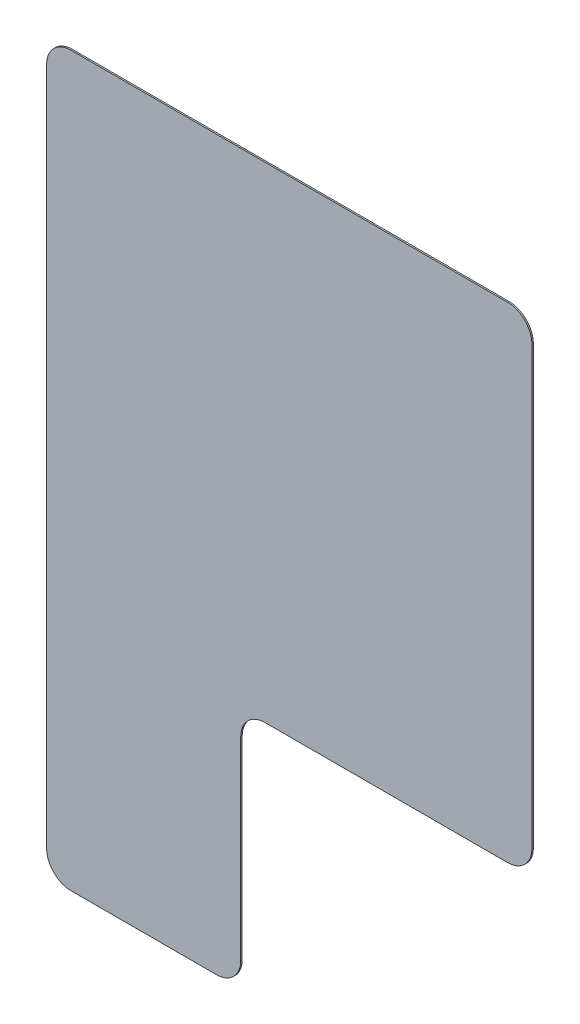
ISO-10303-21;
HEADER;
FILE_DESCRIPTION(('STEP AP214'),'2;1');
FILE_NAME('part.step','',(''),(''),'','','');
FILE_SCHEMA(('AUTOMOTIVE_DESIGN { 1 0 10303 214 1 1 1 1 }'));
ENDSEC;
DATA;
#1=APPLICATION_CONTEXT('core data for automotive mechanical design processes');
#2=APPLICATION_PROTOCOL_DEFINITION('international standard','automotive_design',2000,#1);
#3=PRODUCT_CONTEXT('',#1,'mechanical');
#4=PRODUCT('Part','Part','',(#3));
#5=PRODUCT_RELATED_PRODUCT_CATEGORY('part','',(#4));
#6=PRODUCT_DEFINITION_FORMATION('','',#4);
#7=PRODUCT_DEFINITION_CONTEXT('part definition',#1,'design');
#8=PRODUCT_DEFINITION('design','',#6,#7);
#9=PRODUCT_DEFINITION_SHAPE('','',#8);
#10=(LENGTH_UNIT() NAMED_UNIT(*) SI_UNIT(.MILLI.,.METRE.));
#11=(NAMED_UNIT(*) PLANE_ANGLE_UNIT() SI_UNIT($,.RADIAN.));
#12=(NAMED_UNIT(*) SI_UNIT($,.STERADIAN.) SOLID_ANGLE_UNIT());
#13=UNCERTAINTY_MEASURE_WITH_UNIT(LENGTH_MEASURE(1.E-05),#10,'distance_accuracy_value','');
#14=(GEOMETRIC_REPRESENTATION_CONTEXT(3) GLOBAL_UNCERTAINTY_ASSIGNED_CONTEXT((#13)) GLOBAL_UNIT_ASSIGNED_CONTEXT((#10,
#11,#12)) REPRESENTATION_CONTEXT('',''));
#15=CARTESIAN_POINT('',(0.,0.,0.));
#16=DIRECTION('',(0.,0.,1.));
#17=DIRECTION('',(1.,0.,0.));
#18=AXIS2_PLACEMENT_3D('',#15,#16,#17);
#19=CARTESIAN_POINT('',(-0.5,0.,0.015));
#20=DIRECTION('',(1.,0.,0.));
#21=DIRECTION('',(0.,0.,-1.));
#22=AXIS2_PLACEMENT_3D('',#19,#20,#21);
#23=PLANE('',#22);
#24=DIRECTION('',(0.,-1.,0.));
#25=VECTOR('',#24,1.);
#26=CARTESIAN_POINT('',(-0.5,0.,0.015));
#27=LINE('',#26,#25);
#28=CARTESIAN_POINT('',(-0.5,-2.75,0.015));
#29=VERTEX_POINT('',#28);
#30=CARTESIAN_POINT('',(-0.5,-4.75,0.015));
#31=VERTEX_POINT('',#30);
#32=EDGE_CURVE('E218',#29,#31,#27,.T.);
#33=ORIENTED_EDGE('',*,*,#32,.T.);
#34=DIRECTION('',(0.,0.,-1.));
#35=VECTOR('',#34,1.);
#36=CARTESIAN_POINT('',(-0.5,-4.75,0.));
#37=LINE('',#36,#35);
#38=CARTESIAN_POINT('',(-0.5,-4.75,0.));
#39=VERTEX_POINT('',#38);
#40=EDGE_CURVE('E189',#31,#39,#37,.T.);
#41=ORIENTED_EDGE('',*,*,#40,.T.);
#42=DIRECTION('',(0.,-1.,0.));
#43=VECTOR('',#42,1.);
#44=CARTESIAN_POINT('',(-0.5,0.,0.));
#45=LINE('',#44,#43);
#46=CARTESIAN_POINT('',(-0.5,-2.75,0.));
#47=VERTEX_POINT('',#46);
#48=EDGE_CURVE('E199',#47,#39,#45,.T.);
#49=ORIENTED_EDGE('',*,*,#48,.F.);
#50=DIRECTION('',(0.,0.,-1.));
#51=VECTOR('',#50,1.);
#52=CARTESIAN_POINT('',(-0.5,-2.75,0.015));
#53=LINE('',#52,#51);
#54=EDGE_CURVE('E187',#47,#29,#53,.F.);
#55=ORIENTED_EDGE('',*,*,#54,.T.);
#56=EDGE_LOOP('',(#33,#41,#49,#55));
#57=FACE_BOUND('',#56,.T.);
#58=ADVANCED_FACE('F35',(#57),#23,.T.);
#59=CARTESIAN_POINT('',(0.,-2.5,0.015));
#60=DIRECTION('',(0.,1.,0.));
#61=DIRECTION('',(0.,0.,1.));
#62=AXIS2_PLACEMENT_3D('',#59,#60,#61);
#63=PLANE('',#62);
#64=DIRECTION('',(1.,0.,0.));
#65=VECTOR('',#64,1.);
#66=CARTESIAN_POINT('',(0.,-2.5,0.015));
#67=LINE('',#66,#65);
#68=CARTESIAN_POINT('',(-0.25,-2.5,0.015));
#69=VERTEX_POINT('',#68);
#70=CARTESIAN_POINT('',(2.25,-2.5,0.015));
#71=VERTEX_POINT('',#70);
#72=EDGE_CURVE('E216',#69,#71,#67,.T.);
#73=ORIENTED_EDGE('',*,*,#72,.F.);
#74=DIRECTION('',(0.,0.,-1.));
#75=VECTOR('',#74,1.);
#76=CARTESIAN_POINT('',(-0.25,-2.5,0.015));
#77=LINE('',#76,#75);
#78=CARTESIAN_POINT('',(-0.25,-2.5,0.));
#79=VERTEX_POINT('',#78);
#80=EDGE_CURVE('E194',#69,#79,#77,.T.);
#81=ORIENTED_EDGE('',*,*,#80,.T.);
#82=DIRECTION('',(1.,0.,0.));
#83=VECTOR('',#82,1.);
#84=CARTESIAN_POINT('',(0.,-2.5,0.));
#85=LINE('',#84,#83);
#86=CARTESIAN_POINT('',(2.25,-2.5,0.));
#87=VERTEX_POINT('',#86);
#88=EDGE_CURVE('E201',#79,#87,#85,.T.);
#89=ORIENTED_EDGE('',*,*,#88,.T.);
#90=DIRECTION('',(0.,0.,-1.));
#91=VECTOR('',#90,1.);
#92=CARTESIAN_POINT('',(2.25,-2.5,0.015));
#93=LINE('',#92,#91);
#94=EDGE_CURVE('E192',#87,#71,#93,.F.);
#95=ORIENTED_EDGE('',*,*,#94,.T.);
#96=EDGE_LOOP('',(#73,#81,#89,#95));
#97=FACE_BOUND('',#96,.T.);
#98=ADVANCED_FACE('F220',(#97),#63,.F.);
#99=CARTESIAN_POINT('',(2.5,0.,0.015));
#100=DIRECTION('',(-1.,0.,0.));
#101=DIRECTION('',(0.,0.,1.));
#102=AXIS2_PLACEMENT_3D('',#99,#100,#101);
#103=PLANE('',#102);
#104=DIRECTION('',(0.,1.,0.));
#105=VECTOR('',#104,1.);
#106=CARTESIAN_POINT('',(2.5,0.,0.));
#107=LINE('',#106,#105);
#108=CARTESIAN_POINT('',(2.5,-2.25,0.));
#109=VERTEX_POINT('',#108);
#110=CARTESIAN_POINT('',(2.5,2.25,0.));
#111=VERTEX_POINT('',#110);
#112=EDGE_CURVE('E146',#109,#111,#107,.T.);
#113=ORIENTED_EDGE('',*,*,#112,.T.);
#114=DIRECTION('',(0.,0.,-1.));
#115=VECTOR('',#114,1.);
#116=CARTESIAN_POINT('',(2.5,2.25,0.015));
#117=LINE('',#116,#115);
#118=CARTESIAN_POINT('',(2.5,2.25,0.015));
#119=VERTEX_POINT('',#118);
#120=EDGE_CURVE('E169',#111,#119,#117,.F.);
#121=ORIENTED_EDGE('',*,*,#120,.T.);
#122=DIRECTION('',(0.,1.,0.));
#123=VECTOR('',#122,1.);
#124=CARTESIAN_POINT('',(2.5,0.,0.015));
#125=LINE('',#124,#123);
#126=CARTESIAN_POINT('',(2.5,-2.25,0.015));
#127=VERTEX_POINT('',#126);
#128=EDGE_CURVE('E222',#127,#119,#125,.T.);
#129=ORIENTED_EDGE('',*,*,#128,.F.);
#130=DIRECTION('',(0.,0.,-1.));
#131=VECTOR('',#130,1.);
#132=CARTESIAN_POINT('',(2.5,-2.25,0.015));
#133=LINE('',#132,#131);
#134=EDGE_CURVE('E166',#127,#109,#133,.T.);
#135=ORIENTED_EDGE('',*,*,#134,.T.);
#136=EDGE_LOOP('',(#113,#121,#129,#135));
#137=FACE_BOUND('',#136,.T.);
#138=ADVANCED_FACE('F250',(#137),#103,.F.);
#139=CARTESIAN_POINT('',(0.,2.5,0.015));
#140=DIRECTION('',(0.,1.,0.));
#141=DIRECTION('',(0.,0.,1.));
#142=AXIS2_PLACEMENT_3D('',#139,#140,#141);
#143=PLANE('',#142);
#144=DIRECTION('',(1.,0.,0.));
#145=VECTOR('',#144,1.);
#146=CARTESIAN_POINT('',(0.,2.5,0.015));
#147=LINE('',#146,#145);
#148=CARTESIAN_POINT('',(-2.25,2.5,0.015));
#149=VERTEX_POINT('',#148);
#150=CARTESIAN_POINT('',(2.25,2.5,0.015));
#151=VERTEX_POINT('',#150);
#152=EDGE_CURVE('E224',#149,#151,#147,.T.);
#153=ORIENTED_EDGE('',*,*,#152,.T.);
#154=DIRECTION('',(0.,0.,-1.));
#155=VECTOR('',#154,1.);
#156=CARTESIAN_POINT('',(2.25,2.5,0.));
#157=LINE('',#156,#155);
#158=CARTESIAN_POINT('',(2.25,2.5,0.));
#159=VERTEX_POINT('',#158);
#160=EDGE_CURVE('E145',#151,#159,#157,.T.);
#161=ORIENTED_EDGE('',*,*,#160,.T.);
#162=DIRECTION('',(1.,0.,0.));
#163=VECTOR('',#162,1.);
#164=CARTESIAN_POINT('',(0.,2.5,0.));
#165=LINE('',#164,#163);
#166=CARTESIAN_POINT('',(-2.25,2.5,0.));
#167=VERTEX_POINT('',#166);
#168=EDGE_CURVE('E128',#167,#159,#165,.T.);
#169=ORIENTED_EDGE('',*,*,#168,.F.);
#170=DIRECTION('',(0.,0.,-1.));
#171=VECTOR('',#170,1.);
#172=CARTESIAN_POINT('',(-2.25,2.5,0.015));
#173=LINE('',#172,#171);
#174=EDGE_CURVE('E142',#167,#149,#173,.F.);
#175=ORIENTED_EDGE('',*,*,#174,.T.);
#176=EDGE_LOOP('',(#153,#161,#169,#175));
#177=FACE_BOUND('',#176,.T.);
#178=ADVANCED_FACE('F141',(#177),#143,.T.);
#179=CARTESIAN_POINT('',(-2.5,0.,0.015));
#180=DIRECTION('',(1.,0.,0.));
#181=DIRECTION('',(0.,0.,-1.));
#182=AXIS2_PLACEMENT_3D('',#179,#180,#181);
#183=PLANE('',#182);
#184=DIRECTION('',(0.,-1.,0.));
#185=VECTOR('',#184,1.);
#186=CARTESIAN_POINT('',(-2.5,0.,0.015));
#187=LINE('',#186,#185);
#188=CARTESIAN_POINT('',(-2.5,2.25,0.015));
#189=VERTEX_POINT('',#188);
#190=CARTESIAN_POINT('',(-2.5,-4.75,0.015));
#191=VERTEX_POINT('',#190);
#192=EDGE_CURVE('E155',#189,#191,#187,.T.);
#193=ORIENTED_EDGE('',*,*,#192,.F.);
#194=DIRECTION('',(0.,0.,-1.));
#195=VECTOR('',#194,1.);
#196=CARTESIAN_POINT('',(-2.5,2.25,0.));
#197=LINE('',#196,#195);
#198=CARTESIAN_POINT('',(-2.5,2.25,0.));
#199=VERTEX_POINT('',#198);
#200=EDGE_CURVE('E181',#189,#199,#197,.T.);
#201=ORIENTED_EDGE('',*,*,#200,.T.);
#202=DIRECTION('',(0.,-1.,0.));
#203=VECTOR('',#202,1.);
#204=CARTESIAN_POINT('',(-2.5,0.,0.));
#205=LINE('',#204,#203);
#206=CARTESIAN_POINT('',(-2.5,-4.75,0.));
#207=VERTEX_POINT('',#206);
#208=EDGE_CURVE('E130',#199,#207,#205,.T.);
#209=ORIENTED_EDGE('',*,*,#208,.T.);
#210=DIRECTION('',(0.,0.,-1.));
#211=VECTOR('',#210,1.);
#212=CARTESIAN_POINT('',(-2.5,-4.75,0.015));
#213=LINE('',#212,#211);
#214=EDGE_CURVE('E179',#207,#191,#213,.F.);
#215=ORIENTED_EDGE('',*,*,#214,.T.);
#216=EDGE_LOOP('',(#193,#201,#209,#215));
#217=FACE_BOUND('',#216,.T.);
#218=ADVANCED_FACE('F243',(#217),#183,.F.);
#219=CARTESIAN_POINT('',(0.,-5.,0.015));
#220=DIRECTION('',(0.,1.,0.));
#221=DIRECTION('',(0.,0.,1.));
#222=AXIS2_PLACEMENT_3D('',#219,#220,#221);
#223=PLANE('',#222);
#224=DIRECTION('',(1.,0.,0.));
#225=VECTOR('',#224,1.);
#226=CARTESIAN_POINT('',(0.,-5.,0.015));
#227=LINE('',#226,#225);
#228=CARTESIAN_POINT('',(-2.25,-5.,0.015));
#229=VERTEX_POINT('',#228);
#230=CARTESIAN_POINT('',(-0.75,-5.,0.015));
#231=VERTEX_POINT('',#230);
#232=EDGE_CURVE('E151',#229,#231,#227,.T.);
#233=ORIENTED_EDGE('',*,*,#232,.F.);
#234=DIRECTION('',(0.,0.,-1.));
#235=VECTOR('',#234,1.);
#236=CARTESIAN_POINT('',(-2.25,-5.,0.015));
#237=LINE('',#236,#235);
#238=CARTESIAN_POINT('',(-2.25,-5.,0.));
#239=VERTEX_POINT('',#238);
#240=EDGE_CURVE('E184',#229,#239,#237,.T.);
#241=ORIENTED_EDGE('',*,*,#240,.T.);
#242=DIRECTION('',(1.,0.,0.));
#243=VECTOR('',#242,1.);
#244=CARTESIAN_POINT('',(0.,-5.,0.));
#245=LINE('',#244,#243);
#246=CARTESIAN_POINT('',(-0.75,-5.,0.));
#247=VERTEX_POINT('',#246);
#248=EDGE_CURVE('E158',#239,#247,#245,.T.);
#249=ORIENTED_EDGE('',*,*,#248,.T.);
#250=DIRECTION('',(0.,0.,-1.));
#251=VECTOR('',#250,1.);
#252=CARTESIAN_POINT('',(-0.75,-5.,0.015));
#253=LINE('',#252,#251);
#254=EDGE_CURVE('E50',#247,#231,#253,.F.);
#255=ORIENTED_EDGE('',*,*,#254,.T.);
#256=EDGE_LOOP('',(#233,#241,#249,#255));
#257=FACE_BOUND('',#256,.T.);
#258=ADVANCED_FACE('F235',(#257),#223,.F.);
#259=CARTESIAN_POINT('',(0.,0.,0.015));
#260=DIRECTION('',(0.,0.,1.));
#261=DIRECTION('',(1.,0.,0.));
#262=AXIS2_PLACEMENT_3D('',#259,#260,#261);
#263=PLANE('',#262);
#264=ORIENTED_EDGE('',*,*,#128,.T.);
#265=CARTESIAN_POINT('',(2.25,2.25,0.015));
#266=DIRECTION('',(0.,0.,1.));
#267=DIRECTION('',(1.,0.,0.));
#268=AXIS2_PLACEMENT_3D('',#265,#266,#267);
#269=CIRCLE('',#268,0.25);
#270=EDGE_CURVE('E177',#119,#151,#269,.T.);
#271=ORIENTED_EDGE('',*,*,#270,.T.);
#272=ORIENTED_EDGE('',*,*,#152,.F.);
#273=CARTESIAN_POINT('',(-2.25,2.25,0.015));
#274=DIRECTION('',(0.,0.,1.));
#275=DIRECTION('',(1.,0.,0.));
#276=AXIS2_PLACEMENT_3D('',#273,#274,#275);
#277=CIRCLE('',#276,0.25);
#278=EDGE_CURVE('E150',#149,#189,#277,.T.);
#279=ORIENTED_EDGE('',*,*,#278,.T.);
#280=ORIENTED_EDGE('',*,*,#192,.T.);
#281=CARTESIAN_POINT('',(-2.25,-4.75,0.015));
#282=DIRECTION('',(0.,0.,1.));
#283=DIRECTION('',(1.,0.,0.));
#284=AXIS2_PLACEMENT_3D('',#281,#282,#283);
#285=CIRCLE('',#284,0.25);
#286=EDGE_CURVE('E57',#191,#229,#285,.T.);
#287=ORIENTED_EDGE('',*,*,#286,.T.);
#288=ORIENTED_EDGE('',*,*,#232,.T.);
#289=CARTESIAN_POINT('',(-0.75,-4.75,0.015));
#290=DIRECTION('',(0.,0.,1.));
#291=DIRECTION('',(1.,0.,0.));
#292=AXIS2_PLACEMENT_3D('',#289,#290,#291);
#293=CIRCLE('',#292,0.25);
#294=EDGE_CURVE('E173',#231,#31,#293,.T.);
#295=ORIENTED_EDGE('',*,*,#294,.T.);
#296=ORIENTED_EDGE('',*,*,#32,.F.);
#297=CARTESIAN_POINT('',(-0.25,-2.75,0.015));
#298=DIRECTION('',(0.,0.,1.));
#299=DIRECTION('',(1.,0.,0.));
#300=AXIS2_PLACEMENT_3D('',#297,#298,#299);
#301=CIRCLE('',#300,0.25);
#302=EDGE_CURVE('E11',#29,#69,#301,.F.);
#303=ORIENTED_EDGE('',*,*,#302,.T.);
#304=ORIENTED_EDGE('',*,*,#72,.T.);
#305=CARTESIAN_POINT('',(2.25,-2.25,0.015));
#306=DIRECTION('',(0.,0.,1.));
#307=DIRECTION('',(1.,0.,0.));
#308=AXIS2_PLACEMENT_3D('',#305,#306,#307);
#309=CIRCLE('',#308,0.25);
#310=EDGE_CURVE('E171',#71,#127,#309,.T.);
#311=ORIENTED_EDGE('',*,*,#310,.T.);
#312=EDGE_LOOP('',(#264,#271,#272,#279,#280,#287,#288,#295,#296,#303,#304,#311));
#313=FACE_BOUND('',#312,.T.);
#314=ADVANCED_FACE('F215',(#313),#263,.T.);
#315=CARTESIAN_POINT('',(0.,0.,0.));
#316=DIRECTION('',(0.,0.,1.));
#317=DIRECTION('',(1.,0.,0.));
#318=AXIS2_PLACEMENT_3D('',#315,#316,#317);
#319=PLANE('',#318);
#320=ORIENTED_EDGE('',*,*,#168,.T.);
#321=CARTESIAN_POINT('',(2.25,2.25,0.));
#322=DIRECTION('',(0.,0.,1.));
#323=DIRECTION('',(1.,0.,0.));
#324=AXIS2_PLACEMENT_3D('',#321,#322,#323);
#325=CIRCLE('',#324,0.25);
#326=EDGE_CURVE('E135',#159,#111,#325,.F.);
#327=ORIENTED_EDGE('',*,*,#326,.T.);
#328=ORIENTED_EDGE('',*,*,#112,.F.);
#329=CARTESIAN_POINT('',(2.25,-2.25,0.));
#330=DIRECTION('',(0.,0.,1.));
#331=DIRECTION('',(1.,0.,0.));
#332=AXIS2_PLACEMENT_3D('',#329,#330,#331);
#333=CIRCLE('',#332,0.25);
#334=EDGE_CURVE('E153',#109,#87,#333,.F.);
#335=ORIENTED_EDGE('',*,*,#334,.T.);
#336=ORIENTED_EDGE('',*,*,#88,.F.);
#337=CARTESIAN_POINT('',(-0.25,-2.75,0.));
#338=DIRECTION('',(0.,0.,1.));
#339=DIRECTION('',(1.,0.,0.));
#340=AXIS2_PLACEMENT_3D('',#337,#338,#339);
#341=CIRCLE('',#340,0.25);
#342=EDGE_CURVE('E43',#79,#47,#341,.T.);
#343=ORIENTED_EDGE('',*,*,#342,.T.);
#344=ORIENTED_EDGE('',*,*,#48,.T.);
#345=CARTESIAN_POINT('',(-0.75,-4.75,0.));
#346=DIRECTION('',(0.,0.,1.));
#347=DIRECTION('',(1.,0.,0.));
#348=AXIS2_PLACEMENT_3D('',#345,#346,#347);
#349=CIRCLE('',#348,0.25);
#350=EDGE_CURVE('E162',#39,#247,#349,.F.);
#351=ORIENTED_EDGE('',*,*,#350,.T.);
#352=ORIENTED_EDGE('',*,*,#248,.F.);
#353=CARTESIAN_POINT('',(-2.25,-4.75,0.));
#354=DIRECTION('',(0.,0.,1.));
#355=DIRECTION('',(1.,0.,0.));
#356=AXIS2_PLACEMENT_3D('',#353,#354,#355);
#357=CIRCLE('',#356,0.25);
#358=EDGE_CURVE('E136',#239,#207,#357,.F.);
#359=ORIENTED_EDGE('',*,*,#358,.T.);
#360=ORIENTED_EDGE('',*,*,#208,.F.);
#361=CARTESIAN_POINT('',(-2.25,2.25,0.));
#362=DIRECTION('',(0.,0.,1.));
#363=DIRECTION('',(1.,0.,0.));
#364=AXIS2_PLACEMENT_3D('',#361,#362,#363);
#365=CIRCLE('',#364,0.25);
#366=EDGE_CURVE('E125',#199,#167,#365,.F.);
#367=ORIENTED_EDGE('',*,*,#366,.T.);
#368=EDGE_LOOP('',(#320,#327,#328,#335,#336,#343,#344,#351,#352,#359,#360,#367));
#369=FACE_BOUND('',#368,.T.);
#370=ADVANCED_FACE('F127',(#369),#319,.F.);
#371=CARTESIAN_POINT('',(2.25,2.25,0.015));
#372=DIRECTION('',(0.,0.,1.));
#373=DIRECTION('',(1.,0.,0.));
#374=AXIS2_PLACEMENT_3D('',#371,#372,#373);
#375=CYLINDRICAL_SURFACE('',#374,0.25);
#376=ORIENTED_EDGE('',*,*,#270,.F.);
#377=ORIENTED_EDGE('',*,*,#120,.F.);
#378=ORIENTED_EDGE('',*,*,#326,.F.);
#379=ORIENTED_EDGE('',*,*,#160,.F.);
#380=EDGE_LOOP('',(#376,#377,#378,#379));
#381=FACE_BOUND('',#380,.T.);
#382=ADVANCED_FACE('F246',(#381),#375,.T.);
#383=CARTESIAN_POINT('',(-2.25,2.25,0.015));
#384=DIRECTION('',(0.,0.,1.));
#385=DIRECTION('',(1.,0.,0.));
#386=AXIS2_PLACEMENT_3D('',#383,#384,#385);
#387=CYLINDRICAL_SURFACE('',#386,0.25);
#388=ORIENTED_EDGE('',*,*,#278,.F.);
#389=ORIENTED_EDGE('',*,*,#174,.F.);
#390=ORIENTED_EDGE('',*,*,#366,.F.);
#391=ORIENTED_EDGE('',*,*,#200,.F.);
#392=EDGE_LOOP('',(#388,#389,#390,#391));
#393=FACE_BOUND('',#392,.T.);
#394=ADVANCED_FACE('F149',(#393),#387,.T.);
#395=CARTESIAN_POINT('',(-2.25,-4.75,0.015));
#396=DIRECTION('',(0.,0.,-1.));
#397=DIRECTION('',(-1.,0.,0.));
#398=AXIS2_PLACEMENT_3D('',#395,#396,#397);
#399=CYLINDRICAL_SURFACE('',#398,0.25);
#400=ORIENTED_EDGE('',*,*,#286,.F.);
#401=ORIENTED_EDGE('',*,*,#214,.F.);
#402=ORIENTED_EDGE('',*,*,#358,.F.);
#403=ORIENTED_EDGE('',*,*,#240,.F.);
#404=EDGE_LOOP('',(#400,#401,#402,#403));
#405=FACE_BOUND('',#404,.T.);
#406=ADVANCED_FACE('F241',(#405),#399,.T.);
#407=CARTESIAN_POINT('',(-0.75,-4.75,0.015));
#408=DIRECTION('',(0.,0.,1.));
#409=DIRECTION('',(1.,0.,0.));
#410=AXIS2_PLACEMENT_3D('',#407,#408,#409);
#411=CYLINDRICAL_SURFACE('',#410,0.25);
#412=ORIENTED_EDGE('',*,*,#294,.F.);
#413=ORIENTED_EDGE('',*,*,#254,.F.);
#414=ORIENTED_EDGE('',*,*,#350,.F.);
#415=ORIENTED_EDGE('',*,*,#40,.F.);
#416=EDGE_LOOP('',(#412,#413,#414,#415));
#417=FACE_BOUND('',#416,.T.);
#418=ADVANCED_FACE('F239',(#417),#411,.T.);
#419=CARTESIAN_POINT('',(-0.25,-2.75,0.015));
#420=DIRECTION('',(0.,0.,-1.));
#421=DIRECTION('',(-1.,0.,0.));
#422=AXIS2_PLACEMENT_3D('',#419,#420,#421);
#423=CYLINDRICAL_SURFACE('',#422,0.25);
#424=ORIENTED_EDGE('',*,*,#302,.F.);
#425=ORIENTED_EDGE('',*,*,#54,.F.);
#426=ORIENTED_EDGE('',*,*,#342,.F.);
#427=ORIENTED_EDGE('',*,*,#80,.F.);
#428=EDGE_LOOP('',(#424,#425,#426,#427));
#429=FACE_BOUND('',#428,.T.);
#430=ADVANCED_FACE('F211',(#429),#423,.F.);
#431=CARTESIAN_POINT('',(2.25,-2.25,0.015));
#432=DIRECTION('',(0.,0.,-1.));
#433=DIRECTION('',(-1.,0.,0.));
#434=AXIS2_PLACEMENT_3D('',#431,#432,#433);
#435=CYLINDRICAL_SURFACE('',#434,0.25);
#436=ORIENTED_EDGE('',*,*,#310,.F.);
#437=ORIENTED_EDGE('',*,*,#94,.F.);
#438=ORIENTED_EDGE('',*,*,#334,.F.);
#439=ORIENTED_EDGE('',*,*,#134,.F.);
#440=EDGE_LOOP('',(#436,#437,#438,#439));
#441=FACE_BOUND('',#440,.T.);
#442=ADVANCED_FACE('F37',(#441),#435,.T.);
#443=CLOSED_SHELL('',(#58,#98,#138,#178,#218,#258,#314,#370,#382,#394,#406,#418,#430,#442));
#444=MANIFOLD_SOLID_BREP('B2',#443);
#445=ADVANCED_BREP_SHAPE_REPRESENTATION('',(#18,#444),#14);
#446=SHAPE_DEFINITION_REPRESENTATION(#9,#445);
ENDSEC;
END-ISO-10303-21;
